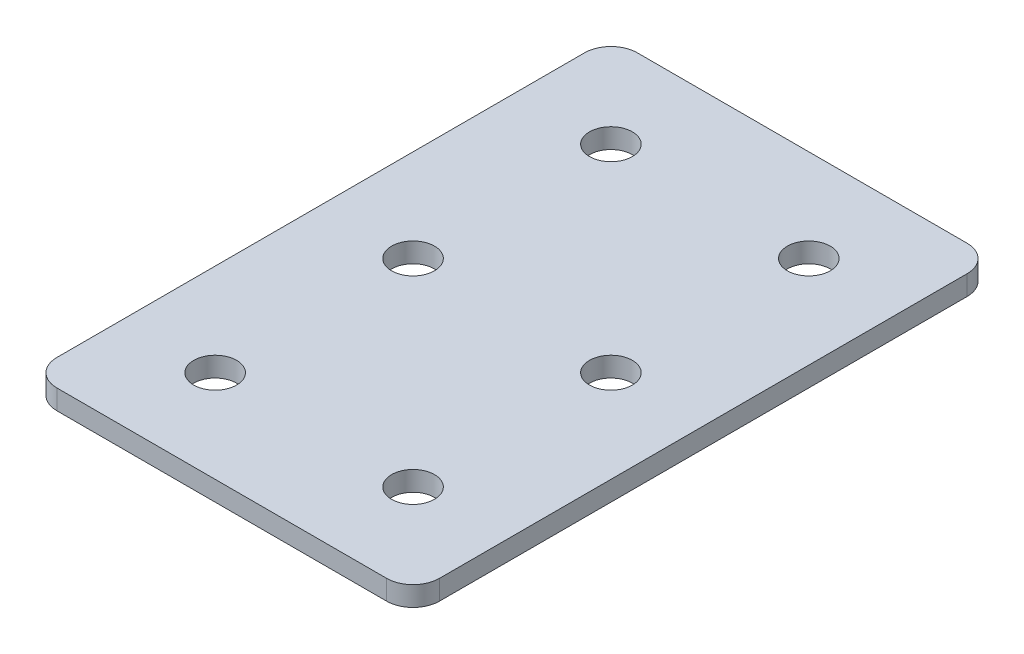
ISO-10303-21;
HEADER;
FILE_DESCRIPTION(('STEP AP214'),'2;1');
FILE_NAME('part.step','',(''),(''),'','','');
FILE_SCHEMA(('AUTOMOTIVE_DESIGN { 1 0 10303 214 1 1 1 1 }'));
ENDSEC;
DATA;
#1=APPLICATION_CONTEXT('core data for automotive mechanical design processes');
#2=APPLICATION_PROTOCOL_DEFINITION('international standard','automotive_design',2000,#1);
#3=PRODUCT_CONTEXT('',#1,'mechanical');
#4=PRODUCT('Part','Part','',(#3));
#5=PRODUCT_RELATED_PRODUCT_CATEGORY('part','',(#4));
#6=PRODUCT_DEFINITION_FORMATION('','',#4);
#7=PRODUCT_DEFINITION_CONTEXT('part definition',#1,'design');
#8=PRODUCT_DEFINITION('design','',#6,#7);
#9=PRODUCT_DEFINITION_SHAPE('','',#8);
#10=(LENGTH_UNIT() NAMED_UNIT(*) SI_UNIT(.MILLI.,.METRE.));
#11=(NAMED_UNIT(*) PLANE_ANGLE_UNIT() SI_UNIT($,.RADIAN.));
#12=(NAMED_UNIT(*) SI_UNIT($,.STERADIAN.) SOLID_ANGLE_UNIT());
#13=UNCERTAINTY_MEASURE_WITH_UNIT(LENGTH_MEASURE(1.E-05),#10,'distance_accuracy_value','');
#14=(GEOMETRIC_REPRESENTATION_CONTEXT(3) GLOBAL_UNCERTAINTY_ASSIGNED_CONTEXT((#13)) GLOBAL_UNIT_ASSIGNED_CONTEXT((#10,
#11,#12)) REPRESENTATION_CONTEXT('',''));
#15=CARTESIAN_POINT('',(0.,0.,0.));
#16=DIRECTION('',(0.,0.,1.));
#17=DIRECTION('',(1.,0.,0.));
#18=AXIS2_PLACEMENT_3D('',#15,#16,#17);
#19=CARTESIAN_POINT('',(-1.37420990733972,2.17462627720624,-16.5499410746997));
#20=DIRECTION('',(0.,-1.,0.));
#21=DIRECTION('',(0.,0.,-1.));
#22=AXIS2_PLACEMENT_3D('',#19,#20,#21);
#23=PLANE('',#22);
#24=CARTESIAN_POINT('',(6.12579009266029,2.17462627720624,13.4500589253003));
#25=DIRECTION('',(0.,1.,0.));
#26=DIRECTION('',(0.,0.,1.));
#27=AXIS2_PLACEMENT_3D('',#24,#25,#26);
#28=CIRCLE('',#27,1.625);
#29=CARTESIAN_POINT('',(6.12579009266029,2.17462627720624,15.0750589253003));
#30=VERTEX_POINT('',#29);
#31=EDGE_CURVE('E177',#30,#30,#28,.T.);
#32=ORIENTED_EDGE('',*,*,#31,.T.);
#33=EDGE_LOOP('',(#32));
#34=FACE_BOUND('',#33,.T.);
#35=CARTESIAN_POINT('',(-8.87420990733975,2.17462627720624,13.4500589253003));
#36=DIRECTION('',(0.,1.,0.));
#37=DIRECTION('',(0.,0.,1.));
#38=AXIS2_PLACEMENT_3D('',#35,#36,#37);
#39=CIRCLE('',#38,1.625);
#40=CARTESIAN_POINT('',(-8.87420990733975,2.17462627720624,15.0750589253003));
#41=VERTEX_POINT('',#40);
#42=EDGE_CURVE('E171',#41,#41,#39,.T.);
#43=ORIENTED_EDGE('',*,*,#42,.T.);
#44=EDGE_LOOP('',(#43));
#45=FACE_BOUND('',#44,.T.);
#46=CARTESIAN_POINT('',(6.12579009266029,2.17462627720624,-1.54994107469971));
#47=DIRECTION('',(0.,1.,0.));
#48=DIRECTION('',(0.,0.,1.));
#49=AXIS2_PLACEMENT_3D('',#46,#47,#48);
#50=CIRCLE('',#49,1.625);
#51=CARTESIAN_POINT('',(6.12579009266029,2.17462627720624,0.0750589253002945));
#52=VERTEX_POINT('',#51);
#53=EDGE_CURVE('E165',#52,#52,#50,.T.);
#54=ORIENTED_EDGE('',*,*,#53,.T.);
#55=EDGE_LOOP('',(#54));
#56=FACE_BOUND('',#55,.T.);
#57=CARTESIAN_POINT('',(-8.87420990733975,2.17462627720624,-1.54994107469971));
#58=DIRECTION('',(0.,1.,0.));
#59=DIRECTION('',(0.,0.,1.));
#60=AXIS2_PLACEMENT_3D('',#57,#58,#59);
#61=CIRCLE('',#60,1.625);
#62=CARTESIAN_POINT('',(-8.87420990733975,2.17462627720624,0.0750589253002945));
#63=VERTEX_POINT('',#62);
#64=EDGE_CURVE('E159',#63,#63,#61,.T.);
#65=ORIENTED_EDGE('',*,*,#64,.T.);
#66=EDGE_LOOP('',(#65));
#67=FACE_BOUND('',#66,.T.);
#68=CARTESIAN_POINT('',(6.12579009266029,2.17462627720624,-16.5499410746997));
#69=DIRECTION('',(0.,1.,0.));
#70=DIRECTION('',(0.,0.,1.));
#71=AXIS2_PLACEMENT_3D('',#68,#69,#70);
#72=CIRCLE('',#71,1.625);
#73=CARTESIAN_POINT('',(6.12579009266029,2.17462627720624,-14.9249410746997));
#74=VERTEX_POINT('',#73);
#75=EDGE_CURVE('E154',#74,#74,#72,.T.);
#76=ORIENTED_EDGE('',*,*,#75,.T.);
#77=EDGE_LOOP('',(#76));
#78=FACE_BOUND('',#77,.T.);
#79=CARTESIAN_POINT('',(-8.87420990733975,2.17462627720624,-16.5499410746997));
#80=DIRECTION('',(0.,1.,0.));
#81=DIRECTION('',(0.,0.,1.));
#82=AXIS2_PLACEMENT_3D('',#79,#80,#81);
#83=CIRCLE('',#82,1.625);
#84=CARTESIAN_POINT('',(-8.87420990733975,2.17462627720624,-14.9249410746997));
#85=VERTEX_POINT('',#84);
#86=EDGE_CURVE('E147',#85,#85,#83,.T.);
#87=ORIENTED_EDGE('',*,*,#86,.T.);
#88=EDGE_LOOP('',(#87));
#89=FACE_BOUND('',#88,.T.);
#90=DIRECTION('',(0.,0.,-1.));
#91=VECTOR('',#90,1.);
#92=CARTESIAN_POINT('',(13.1257900926604,2.17462627720624,20.4500589253002));
#93=LINE('',#92,#91);
#94=CARTESIAN_POINT('',(13.1257900926604,2.17462627720624,18.4500589253002));
#95=VERTEX_POINT('',#94);
#96=CARTESIAN_POINT('',(13.1257900926604,2.17462627720624,-21.5499410746997));
#97=VERTEX_POINT('',#96);
#98=EDGE_CURVE('E106',#95,#97,#93,.T.);
#99=ORIENTED_EDGE('',*,*,#98,.F.);
#100=CARTESIAN_POINT('',(11.1257900926604,2.17462627720624,18.4500589253002));
#101=DIRECTION('',(0.,-1.,0.));
#102=DIRECTION('',(0.,0.,-1.));
#103=AXIS2_PLACEMENT_3D('',#100,#101,#102);
#104=CIRCLE('',#103,2.);
#105=CARTESIAN_POINT('',(11.1257900926604,2.17462627720624,20.4500589253002));
#106=VERTEX_POINT('',#105);
#107=EDGE_CURVE('E128',#95,#106,#104,.T.);
#108=ORIENTED_EDGE('',*,*,#107,.T.);
#109=DIRECTION('',(1.,0.,0.));
#110=VECTOR('',#109,1.);
#111=CARTESIAN_POINT('',(-15.8742099073398,2.17462627720624,20.4500589253003));
#112=LINE('',#111,#110);
#113=CARTESIAN_POINT('',(-13.8742099073398,2.17462627720624,20.4500589253003));
#114=VERTEX_POINT('',#113);
#115=EDGE_CURVE('E110',#114,#106,#112,.T.);
#116=ORIENTED_EDGE('',*,*,#115,.F.);
#117=CARTESIAN_POINT('',(-13.8742099073398,2.17462627720624,18.4500589253003));
#118=DIRECTION('',(0.,-1.,0.));
#119=DIRECTION('',(0.,0.,-1.));
#120=AXIS2_PLACEMENT_3D('',#117,#118,#119);
#121=CIRCLE('',#120,2.);
#122=CARTESIAN_POINT('',(-15.8742099073398,2.17462627720624,18.4500589253003));
#123=VERTEX_POINT('',#122);
#124=EDGE_CURVE('E105',#114,#123,#121,.T.);
#125=ORIENTED_EDGE('',*,*,#124,.T.);
#126=DIRECTION('',(0.,0.,1.));
#127=VECTOR('',#126,1.);
#128=CARTESIAN_POINT('',(-15.8742099073398,2.17462627720624,-23.5499410746997));
#129=LINE('',#128,#127);
#130=CARTESIAN_POINT('',(-15.8742099073398,2.17462627720624,-21.5499410746997));
#131=VERTEX_POINT('',#130);
#132=EDGE_CURVE('E137',#131,#123,#129,.T.);
#133=ORIENTED_EDGE('',*,*,#132,.F.);
#134=CARTESIAN_POINT('',(-13.8742099073398,2.17462627720624,-21.5499410746997));
#135=DIRECTION('',(0.,-1.,0.));
#136=DIRECTION('',(0.,0.,-1.));
#137=AXIS2_PLACEMENT_3D('',#134,#135,#136);
#138=CIRCLE('',#137,2.);
#139=CARTESIAN_POINT('',(-13.8742099073398,2.17462627720624,-23.5499410746997));
#140=VERTEX_POINT('',#139);
#141=EDGE_CURVE('E31',#131,#140,#138,.T.);
#142=ORIENTED_EDGE('',*,*,#141,.T.);
#143=DIRECTION('',(-1.,0.,0.));
#144=VECTOR('',#143,1.);
#145=CARTESIAN_POINT('',(13.1257900926604,2.17462627720624,-23.5499410746997));
#146=LINE('',#145,#144);
#147=CARTESIAN_POINT('',(11.1257900926604,2.17462627720624,-23.5499410746997));
#148=VERTEX_POINT('',#147);
#149=EDGE_CURVE('E138',#148,#140,#146,.T.);
#150=ORIENTED_EDGE('',*,*,#149,.F.);
#151=CARTESIAN_POINT('',(11.1257900926604,2.17462627720624,-21.5499410746997));
#152=DIRECTION('',(0.,-1.,0.));
#153=DIRECTION('',(0.,0.,-1.));
#154=AXIS2_PLACEMENT_3D('',#151,#152,#153);
#155=CIRCLE('',#154,2.);
#156=EDGE_CURVE('E126',#148,#97,#155,.T.);
#157=ORIENTED_EDGE('',*,*,#156,.T.);
#158=EDGE_LOOP('',(#99,#108,#116,#125,#133,#142,#150,#157));
#159=FACE_BOUND('',#158,.T.);
#160=ADVANCED_FACE('F16',(#34,#45,#56,#67,#78,#89,#159),#23,.T.);
#161=CARTESIAN_POINT('',(13.1257900926604,2.17462627720624,-23.5499410746997));
#162=DIRECTION('',(0.,0.,-1.));
#163=DIRECTION('',(-1.,0.,0.));
#164=AXIS2_PLACEMENT_3D('',#161,#162,#163);
#165=PLANE('',#164);
#166=DIRECTION('',(-1.,0.,0.));
#167=VECTOR('',#166,1.);
#168=CARTESIAN_POINT('',(13.1257900926604,3.67462627720624,-23.5499410746997));
#169=LINE('',#168,#167);
#170=CARTESIAN_POINT('',(11.1257900926604,3.67462627720624,-23.5499410746997));
#171=VERTEX_POINT('',#170);
#172=CARTESIAN_POINT('',(-13.8742099073398,3.67462627720624,-23.5499410746997));
#173=VERTEX_POINT('',#172);
#174=EDGE_CURVE('E144',#171,#173,#169,.T.);
#175=ORIENTED_EDGE('',*,*,#174,.F.);
#176=DIRECTION('',(0.,1.,0.));
#177=VECTOR('',#176,1.);
#178=CARTESIAN_POINT('',(11.1257900926604,2.17462627720624,-23.5499410746997));
#179=LINE('',#178,#177);
#180=EDGE_CURVE('E38',#171,#148,#179,.F.);
#181=ORIENTED_EDGE('',*,*,#180,.T.);
#182=ORIENTED_EDGE('',*,*,#149,.T.);
#183=DIRECTION('',(0.,1.,0.));
#184=VECTOR('',#183,1.);
#185=CARTESIAN_POINT('',(-13.8742099073398,2.17462627720624,-23.5499410746997));
#186=LINE('',#185,#184);
#187=EDGE_CURVE('E130',#140,#173,#186,.T.);
#188=ORIENTED_EDGE('',*,*,#187,.T.);
#189=EDGE_LOOP('',(#175,#181,#182,#188));
#190=FACE_BOUND('',#189,.T.);
#191=ADVANCED_FACE('F223',(#190),#165,.T.);
#192=CARTESIAN_POINT('',(13.1257900926604,2.17462627720624,20.4500589253002));
#193=DIRECTION('',(1.,0.,0.));
#194=DIRECTION('',(0.,0.,-1.));
#195=AXIS2_PLACEMENT_3D('',#192,#193,#194);
#196=PLANE('',#195);
#197=DIRECTION('',(0.,0.,-1.));
#198=VECTOR('',#197,1.);
#199=CARTESIAN_POINT('',(13.1257900926604,3.67462627720624,20.4500589253002));
#200=LINE('',#199,#198);
#201=CARTESIAN_POINT('',(13.1257900926604,3.67462627720624,18.4500589253002));
#202=VERTEX_POINT('',#201);
#203=CARTESIAN_POINT('',(13.1257900926604,3.67462627720624,-21.5499410746997));
#204=VERTEX_POINT('',#203);
#205=EDGE_CURVE('E102',#202,#204,#200,.T.);
#206=ORIENTED_EDGE('',*,*,#205,.F.);
#207=DIRECTION('',(0.,1.,0.));
#208=VECTOR('',#207,1.);
#209=CARTESIAN_POINT('',(13.1257900926604,2.17462627720624,18.4500589253002));
#210=LINE('',#209,#208);
#211=EDGE_CURVE('E122',#202,#95,#210,.F.);
#212=ORIENTED_EDGE('',*,*,#211,.T.);
#213=ORIENTED_EDGE('',*,*,#98,.T.);
#214=DIRECTION('',(0.,1.,0.));
#215=VECTOR('',#214,1.);
#216=CARTESIAN_POINT('',(13.1257900926604,2.17462627720624,-21.5499410746997));
#217=LINE('',#216,#215);
#218=EDGE_CURVE('E119',#97,#204,#217,.T.);
#219=ORIENTED_EDGE('',*,*,#218,.T.);
#220=EDGE_LOOP('',(#206,#212,#213,#219));
#221=FACE_BOUND('',#220,.T.);
#222=ADVANCED_FACE('F228',(#221),#196,.T.);
#223=CARTESIAN_POINT('',(-15.8742099073398,2.17462627720624,20.4500589253003));
#224=DIRECTION('',(0.,0.,1.));
#225=DIRECTION('',(1.,0.,0.));
#226=AXIS2_PLACEMENT_3D('',#223,#224,#225);
#227=PLANE('',#226);
#228=ORIENTED_EDGE('',*,*,#115,.T.);
#229=DIRECTION('',(0.,1.,0.));
#230=VECTOR('',#229,1.);
#231=CARTESIAN_POINT('',(11.1257900926604,2.17462627720624,20.4500589253002));
#232=LINE('',#231,#230);
#233=CARTESIAN_POINT('',(11.1257900926604,3.67462627720624,20.4500589253002));
#234=VERTEX_POINT('',#233);
#235=EDGE_CURVE('E93',#106,#234,#232,.T.);
#236=ORIENTED_EDGE('',*,*,#235,.T.);
#237=DIRECTION('',(1.,0.,0.));
#238=VECTOR('',#237,1.);
#239=CARTESIAN_POINT('',(-15.8742099073398,3.67462627720624,20.4500589253003));
#240=LINE('',#239,#238);
#241=CARTESIAN_POINT('',(-13.8742099073398,3.67462627720624,20.4500589253003));
#242=VERTEX_POINT('',#241);
#243=EDGE_CURVE('E85',#242,#234,#240,.T.);
#244=ORIENTED_EDGE('',*,*,#243,.F.);
#245=DIRECTION('',(0.,1.,0.));
#246=VECTOR('',#245,1.);
#247=CARTESIAN_POINT('',(-13.8742099073398,2.17462627720624,20.4500589253003));
#248=LINE('',#247,#246);
#249=EDGE_CURVE('E99',#242,#114,#248,.F.);
#250=ORIENTED_EDGE('',*,*,#249,.T.);
#251=EDGE_LOOP('',(#228,#236,#244,#250));
#252=FACE_BOUND('',#251,.T.);
#253=ADVANCED_FACE('F98',(#252),#227,.T.);
#254=CARTESIAN_POINT('',(-15.8742099073398,2.17462627720624,-23.5499410746997));
#255=DIRECTION('',(-1.,0.,0.));
#256=DIRECTION('',(0.,0.,1.));
#257=AXIS2_PLACEMENT_3D('',#254,#255,#256);
#258=PLANE('',#257);
#259=DIRECTION('',(0.,0.,1.));
#260=VECTOR('',#259,1.);
#261=CARTESIAN_POINT('',(-15.8742099073398,3.67462627720624,-23.5499410746997));
#262=LINE('',#261,#260);
#263=CARTESIAN_POINT('',(-15.8742099073398,3.67462627720624,-21.5499410746997));
#264=VERTEX_POINT('',#263);
#265=CARTESIAN_POINT('',(-15.8742099073398,3.67462627720624,18.4500589253003));
#266=VERTEX_POINT('',#265);
#267=EDGE_CURVE('E87',#264,#266,#262,.T.);
#268=ORIENTED_EDGE('',*,*,#267,.F.);
#269=DIRECTION('',(0.,1.,0.));
#270=VECTOR('',#269,1.);
#271=CARTESIAN_POINT('',(-15.8742099073398,2.17462627720624,-21.5499410746997));
#272=LINE('',#271,#270);
#273=EDGE_CURVE('E10',#264,#131,#272,.F.);
#274=ORIENTED_EDGE('',*,*,#273,.T.);
#275=ORIENTED_EDGE('',*,*,#132,.T.);
#276=DIRECTION('',(0.,1.,0.));
#277=VECTOR('',#276,1.);
#278=CARTESIAN_POINT('',(-15.8742099073398,2.17462627720624,18.4500589253003));
#279=LINE('',#278,#277);
#280=EDGE_CURVE('E24',#123,#266,#279,.T.);
#281=ORIENTED_EDGE('',*,*,#280,.T.);
#282=EDGE_LOOP('',(#268,#274,#275,#281));
#283=FACE_BOUND('',#282,.T.);
#284=ADVANCED_FACE('F135',(#283),#258,.T.);
#285=CARTESIAN_POINT('',(-1.37420990733972,3.67462627720624,-16.5499410746997));
#286=DIRECTION('',(0.,-1.,0.));
#287=DIRECTION('',(0.,0.,-1.));
#288=AXIS2_PLACEMENT_3D('',#285,#286,#287);
#289=PLANE('',#288);
#290=CARTESIAN_POINT('',(6.12579009266029,3.67462627720624,13.4500589253003));
#291=DIRECTION('',(0.,1.,0.));
#292=DIRECTION('',(0.,0.,1.));
#293=AXIS2_PLACEMENT_3D('',#290,#291,#292);
#294=CIRCLE('',#293,1.625);
#295=CARTESIAN_POINT('',(6.12579009266029,3.67462627720624,15.0750589253003));
#296=VERTEX_POINT('',#295);
#297=EDGE_CURVE('E180',#296,#296,#294,.T.);
#298=ORIENTED_EDGE('',*,*,#297,.F.);
#299=EDGE_LOOP('',(#298));
#300=FACE_BOUND('',#299,.T.);
#301=CARTESIAN_POINT('',(-8.87420990733975,3.67462627720624,13.4500589253003));
#302=DIRECTION('',(0.,1.,0.));
#303=DIRECTION('',(0.,0.,1.));
#304=AXIS2_PLACEMENT_3D('',#301,#302,#303);
#305=CIRCLE('',#304,1.625);
#306=CARTESIAN_POINT('',(-8.87420990733975,3.67462627720624,15.0750589253003));
#307=VERTEX_POINT('',#306);
#308=EDGE_CURVE('E174',#307,#307,#305,.T.);
#309=ORIENTED_EDGE('',*,*,#308,.F.);
#310=EDGE_LOOP('',(#309));
#311=FACE_BOUND('',#310,.T.);
#312=CARTESIAN_POINT('',(6.12579009266029,3.67462627720624,-1.54994107469971));
#313=DIRECTION('',(0.,1.,0.));
#314=DIRECTION('',(0.,0.,1.));
#315=AXIS2_PLACEMENT_3D('',#312,#313,#314);
#316=CIRCLE('',#315,1.625);
#317=CARTESIAN_POINT('',(6.12579009266029,3.67462627720624,0.0750589253002945));
#318=VERTEX_POINT('',#317);
#319=EDGE_CURVE('E168',#318,#318,#316,.T.);
#320=ORIENTED_EDGE('',*,*,#319,.F.);
#321=EDGE_LOOP('',(#320));
#322=FACE_BOUND('',#321,.T.);
#323=CARTESIAN_POINT('',(-8.87420990733975,3.67462627720624,-1.54994107469971));
#324=DIRECTION('',(0.,1.,0.));
#325=DIRECTION('',(0.,0.,1.));
#326=AXIS2_PLACEMENT_3D('',#323,#324,#325);
#327=CIRCLE('',#326,1.625);
#328=CARTESIAN_POINT('',(-8.87420990733975,3.67462627720624,0.0750589253002945));
#329=VERTEX_POINT('',#328);
#330=EDGE_CURVE('E162',#329,#329,#327,.T.);
#331=ORIENTED_EDGE('',*,*,#330,.F.);
#332=EDGE_LOOP('',(#331));
#333=FACE_BOUND('',#332,.T.);
#334=CARTESIAN_POINT('',(6.12579009266029,3.67462627720624,-16.5499410746997));
#335=DIRECTION('',(0.,1.,0.));
#336=DIRECTION('',(0.,0.,1.));
#337=AXIS2_PLACEMENT_3D('',#334,#335,#336);
#338=CIRCLE('',#337,1.625);
#339=CARTESIAN_POINT('',(6.12579009266029,3.67462627720624,-14.9249410746997));
#340=VERTEX_POINT('',#339);
#341=EDGE_CURVE('E156',#340,#340,#338,.T.);
#342=ORIENTED_EDGE('',*,*,#341,.F.);
#343=EDGE_LOOP('',(#342));
#344=FACE_BOUND('',#343,.T.);
#345=CARTESIAN_POINT('',(-8.87420990733975,3.67462627720624,-16.5499410746997));
#346=DIRECTION('',(0.,1.,0.));
#347=DIRECTION('',(0.,0.,1.));
#348=AXIS2_PLACEMENT_3D('',#345,#346,#347);
#349=CIRCLE('',#348,1.625);
#350=CARTESIAN_POINT('',(-8.87420990733975,3.67462627720624,-14.9249410746997));
#351=VERTEX_POINT('',#350);
#352=EDGE_CURVE('E149',#351,#351,#349,.T.);
#353=ORIENTED_EDGE('',*,*,#352,.F.);
#354=EDGE_LOOP('',(#353));
#355=FACE_BOUND('',#354,.T.);
#356=ORIENTED_EDGE('',*,*,#243,.T.);
#357=CARTESIAN_POINT('',(11.1257900926604,3.67462627720624,18.4500589253002));
#358=DIRECTION('',(0.,-1.,0.));
#359=DIRECTION('',(0.,0.,-1.));
#360=AXIS2_PLACEMENT_3D('',#357,#358,#359);
#361=CIRCLE('',#360,2.);
#362=EDGE_CURVE('E117',#234,#202,#361,.F.);
#363=ORIENTED_EDGE('',*,*,#362,.T.);
#364=ORIENTED_EDGE('',*,*,#205,.T.);
#365=CARTESIAN_POINT('',(11.1257900926604,3.67462627720624,-21.5499410746997));
#366=DIRECTION('',(0.,-1.,0.));
#367=DIRECTION('',(0.,0.,-1.));
#368=AXIS2_PLACEMENT_3D('',#365,#366,#367);
#369=CIRCLE('',#368,2.);
#370=EDGE_CURVE('E115',#204,#171,#369,.F.);
#371=ORIENTED_EDGE('',*,*,#370,.T.);
#372=ORIENTED_EDGE('',*,*,#174,.T.);
#373=CARTESIAN_POINT('',(-13.8742099073398,3.67462627720624,-21.5499410746997));
#374=DIRECTION('',(0.,-1.,0.));
#375=DIRECTION('',(0.,0.,-1.));
#376=AXIS2_PLACEMENT_3D('',#373,#374,#375);
#377=CIRCLE('',#376,2.);
#378=EDGE_CURVE('E92',#173,#264,#377,.F.);
#379=ORIENTED_EDGE('',*,*,#378,.T.);
#380=ORIENTED_EDGE('',*,*,#267,.T.);
#381=CARTESIAN_POINT('',(-13.8742099073398,3.67462627720624,18.4500589253003));
#382=DIRECTION('',(0.,-1.,0.));
#383=DIRECTION('',(0.,0.,-1.));
#384=AXIS2_PLACEMENT_3D('',#381,#382,#383);
#385=CIRCLE('',#384,2.);
#386=EDGE_CURVE('E82',#266,#242,#385,.F.);
#387=ORIENTED_EDGE('',*,*,#386,.T.);
#388=EDGE_LOOP('',(#356,#363,#364,#371,#372,#379,#380,#387));
#389=FACE_BOUND('',#388,.T.);
#390=ADVANCED_FACE('F84',(#300,#311,#322,#333,#344,#355,#389),#289,.F.);
#391=CARTESIAN_POINT('',(-8.87420990733975,2.17462627720624,-16.5499410746997));
#392=DIRECTION('',(0.,1.,0.));
#393=DIRECTION('',(0.,0.,1.));
#394=AXIS2_PLACEMENT_3D('',#391,#392,#393);
#395=CYLINDRICAL_SURFACE('',#394,1.625);
#396=ORIENTED_EDGE('',*,*,#86,.F.);
#397=EDGE_LOOP('',(#396));
#398=FACE_BOUND('',#397,.T.);
#399=ORIENTED_EDGE('',*,*,#352,.T.);
#400=EDGE_LOOP('',(#399));
#401=FACE_BOUND('',#400,.T.);
#402=ADVANCED_FACE('F198',(#398,#401),#395,.F.);
#403=CARTESIAN_POINT('',(6.12579009266029,2.17462627720624,-16.5499410746997));
#404=DIRECTION('',(0.,1.,0.));
#405=DIRECTION('',(0.,0.,1.));
#406=AXIS2_PLACEMENT_3D('',#403,#404,#405);
#407=CYLINDRICAL_SURFACE('',#406,1.625);
#408=ORIENTED_EDGE('',*,*,#75,.F.);
#409=EDGE_LOOP('',(#408));
#410=FACE_BOUND('',#409,.T.);
#411=ORIENTED_EDGE('',*,*,#341,.T.);
#412=EDGE_LOOP('',(#411));
#413=FACE_BOUND('',#412,.T.);
#414=ADVANCED_FACE('F211',(#410,#413),#407,.F.);
#415=CARTESIAN_POINT('',(-8.87420990733975,2.17462627720624,-1.54994107469971));
#416=DIRECTION('',(0.,1.,0.));
#417=DIRECTION('',(0.,0.,1.));
#418=AXIS2_PLACEMENT_3D('',#415,#416,#417);
#419=CYLINDRICAL_SURFACE('',#418,1.625);
#420=ORIENTED_EDGE('',*,*,#64,.F.);
#421=EDGE_LOOP('',(#420));
#422=FACE_BOUND('',#421,.T.);
#423=ORIENTED_EDGE('',*,*,#330,.T.);
#424=EDGE_LOOP('',(#423));
#425=FACE_BOUND('',#424,.T.);
#426=ADVANCED_FACE('F218',(#422,#425),#419,.F.);
#427=CARTESIAN_POINT('',(6.12579009266029,2.17462627720624,-1.54994107469971));
#428=DIRECTION('',(0.,1.,0.));
#429=DIRECTION('',(0.,0.,1.));
#430=AXIS2_PLACEMENT_3D('',#427,#428,#429);
#431=CYLINDRICAL_SURFACE('',#430,1.625);
#432=ORIENTED_EDGE('',*,*,#53,.F.);
#433=EDGE_LOOP('',(#432));
#434=FACE_BOUND('',#433,.T.);
#435=ORIENTED_EDGE('',*,*,#319,.T.);
#436=EDGE_LOOP('',(#435));
#437=FACE_BOUND('',#436,.T.);
#438=ADVANCED_FACE('F291',(#434,#437),#431,.F.);
#439=CARTESIAN_POINT('',(-8.87420990733975,2.17462627720624,13.4500589253003));
#440=DIRECTION('',(0.,1.,0.));
#441=DIRECTION('',(0.,0.,1.));
#442=AXIS2_PLACEMENT_3D('',#439,#440,#441);
#443=CYLINDRICAL_SURFACE('',#442,1.625);
#444=ORIENTED_EDGE('',*,*,#42,.F.);
#445=EDGE_LOOP('',(#444));
#446=FACE_BOUND('',#445,.T.);
#447=ORIENTED_EDGE('',*,*,#308,.T.);
#448=EDGE_LOOP('',(#447));
#449=FACE_BOUND('',#448,.T.);
#450=ADVANCED_FACE('F192',(#446,#449),#443,.F.);
#451=CARTESIAN_POINT('',(6.12579009266029,2.17462627720624,13.4500589253003));
#452=DIRECTION('',(0.,1.,0.));
#453=DIRECTION('',(0.,0.,1.));
#454=AXIS2_PLACEMENT_3D('',#451,#452,#453);
#455=CYLINDRICAL_SURFACE('',#454,1.625);
#456=ORIENTED_EDGE('',*,*,#31,.F.);
#457=EDGE_LOOP('',(#456));
#458=FACE_BOUND('',#457,.T.);
#459=ORIENTED_EDGE('',*,*,#297,.T.);
#460=EDGE_LOOP('',(#459));
#461=FACE_BOUND('',#460,.T.);
#462=ADVANCED_FACE('F188',(#458,#461),#455,.F.);
#463=CARTESIAN_POINT('',(11.1257900926604,2.17462627720624,18.4500589253002));
#464=DIRECTION('',(0.,1.,0.));
#465=DIRECTION('',(0.,0.,1.));
#466=AXIS2_PLACEMENT_3D('',#463,#464,#465);
#467=CYLINDRICAL_SURFACE('',#466,2.);
#468=ORIENTED_EDGE('',*,*,#107,.F.);
#469=ORIENTED_EDGE('',*,*,#211,.F.);
#470=ORIENTED_EDGE('',*,*,#362,.F.);
#471=ORIENTED_EDGE('',*,*,#235,.F.);
#472=EDGE_LOOP('',(#468,#469,#470,#471));
#473=FACE_BOUND('',#472,.T.);
#474=ADVANCED_FACE('F191',(#473),#467,.T.);
#475=CARTESIAN_POINT('',(11.1257900926604,2.17462627720624,-21.5499410746997));
#476=DIRECTION('',(0.,1.,0.));
#477=DIRECTION('',(0.,0.,1.));
#478=AXIS2_PLACEMENT_3D('',#475,#476,#477);
#479=CYLINDRICAL_SURFACE('',#478,2.);
#480=ORIENTED_EDGE('',*,*,#156,.F.);
#481=ORIENTED_EDGE('',*,*,#180,.F.);
#482=ORIENTED_EDGE('',*,*,#370,.F.);
#483=ORIENTED_EDGE('',*,*,#218,.F.);
#484=EDGE_LOOP('',(#480,#481,#482,#483));
#485=FACE_BOUND('',#484,.T.);
#486=ADVANCED_FACE('F233',(#485),#479,.T.);
#487=CARTESIAN_POINT('',(-13.8742099073398,2.17462627720624,-21.5499410746997));
#488=DIRECTION('',(0.,1.,0.));
#489=DIRECTION('',(0.,0.,1.));
#490=AXIS2_PLACEMENT_3D('',#487,#488,#489);
#491=CYLINDRICAL_SURFACE('',#490,2.);
#492=ORIENTED_EDGE('',*,*,#141,.F.);
#493=ORIENTED_EDGE('',*,*,#273,.F.);
#494=ORIENTED_EDGE('',*,*,#378,.F.);
#495=ORIENTED_EDGE('',*,*,#187,.F.);
#496=EDGE_LOOP('',(#492,#493,#494,#495));
#497=FACE_BOUND('',#496,.T.);
#498=ADVANCED_FACE('F236',(#497),#491,.T.);
#499=CARTESIAN_POINT('',(-13.8742099073398,2.17462627720624,18.4500589253003));
#500=DIRECTION('',(0.,1.,0.));
#501=DIRECTION('',(0.,0.,1.));
#502=AXIS2_PLACEMENT_3D('',#499,#500,#501);
#503=CYLINDRICAL_SURFACE('',#502,2.);
#504=ORIENTED_EDGE('',*,*,#124,.F.);
#505=ORIENTED_EDGE('',*,*,#249,.F.);
#506=ORIENTED_EDGE('',*,*,#386,.F.);
#507=ORIENTED_EDGE('',*,*,#280,.F.);
#508=EDGE_LOOP('',(#504,#505,#506,#507));
#509=FACE_BOUND('',#508,.T.);
#510=ADVANCED_FACE('F18',(#509),#503,.T.);
#511=CLOSED_SHELL('',(#160,#191,#222,#253,#284,#390,#402,#414,#426,#438,#450,#462,#474,#486,
#498,#510));
#512=MANIFOLD_SOLID_BREP('B1',#511);
#513=ADVANCED_BREP_SHAPE_REPRESENTATION('',(#18,#512),#14);
#514=SHAPE_DEFINITION_REPRESENTATION(#9,#513);
ENDSEC;
END-ISO-10303-21;
